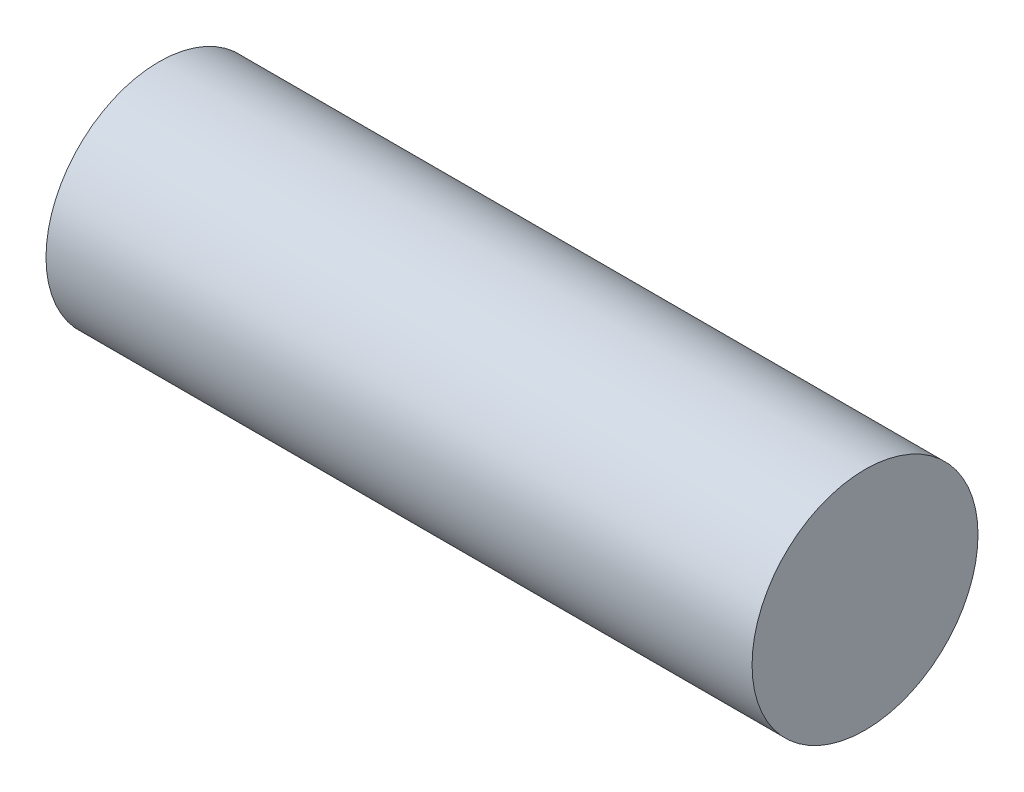
ISO-10303-21;
HEADER;
FILE_DESCRIPTION(('STEP AP214'),'2;1');
FILE_NAME('part.step','',(''),(''),'','','');
FILE_SCHEMA(('AUTOMOTIVE_DESIGN { 1 0 10303 214 1 1 1 1 }'));
ENDSEC;
DATA;
#1=APPLICATION_CONTEXT('core data for automotive mechanical design processes');
#2=APPLICATION_PROTOCOL_DEFINITION('international standard','automotive_design',2000,#1);
#3=PRODUCT_CONTEXT('',#1,'mechanical');
#4=PRODUCT('Part','Part','',(#3));
#5=PRODUCT_RELATED_PRODUCT_CATEGORY('part','',(#4));
#6=PRODUCT_DEFINITION_FORMATION('','',#4);
#7=PRODUCT_DEFINITION_CONTEXT('part definition',#1,'design');
#8=PRODUCT_DEFINITION('design','',#6,#7);
#9=PRODUCT_DEFINITION_SHAPE('','',#8);
#10=(LENGTH_UNIT() NAMED_UNIT(*) SI_UNIT(.MILLI.,.METRE.));
#11=(NAMED_UNIT(*) PLANE_ANGLE_UNIT() SI_UNIT($,.RADIAN.));
#12=(NAMED_UNIT(*) SI_UNIT($,.STERADIAN.) SOLID_ANGLE_UNIT());
#13=UNCERTAINTY_MEASURE_WITH_UNIT(LENGTH_MEASURE(1.E-05),#10,'distance_accuracy_value','');
#14=(GEOMETRIC_REPRESENTATION_CONTEXT(3) GLOBAL_UNCERTAINTY_ASSIGNED_CONTEXT((#13)) GLOBAL_UNIT_ASSIGNED_CONTEXT((#10,
#11,#12)) REPRESENTATION_CONTEXT('',''));
#15=CARTESIAN_POINT('',(0.,0.,0.));
#16=DIRECTION('',(0.,0.,1.));
#17=DIRECTION('',(1.,0.,0.));
#18=AXIS2_PLACEMENT_3D('',#15,#16,#17);
#19=CARTESIAN_POINT('',(25.,0.,0.));
#20=DIRECTION('',(-1.,0.,0.));
#21=DIRECTION('',(0.,0.,-1.));
#22=AXIS2_PLACEMENT_3D('',#19,#20,#21);
#23=CYLINDRICAL_SURFACE('',#22,4.);
#24=CARTESIAN_POINT('',(25.,0.,0.));
#25=DIRECTION('',(-1.,0.,0.));
#26=DIRECTION('',(0.,0.,1.));
#27=AXIS2_PLACEMENT_3D('',#24,#25,#26);
#28=CIRCLE('',#27,4.);
#29=CARTESIAN_POINT('',(25.,0.,4.));
#30=VERTEX_POINT('',#29);
#31=EDGE_CURVE('E10',#30,#30,#28,.T.);
#32=ORIENTED_EDGE('',*,*,#31,.T.);
#33=EDGE_LOOP('',(#32));
#34=FACE_BOUND('',#33,.T.);
#35=CARTESIAN_POINT('',(0.,0.,0.));
#36=DIRECTION('',(-1.,0.,0.));
#37=DIRECTION('',(0.,0.,1.));
#38=AXIS2_PLACEMENT_3D('',#35,#36,#37);
#39=CIRCLE('',#38,4.);
#40=CARTESIAN_POINT('',(0.,0.,4.));
#41=VERTEX_POINT('',#40);
#42=EDGE_CURVE('E38',#41,#41,#39,.T.);
#43=ORIENTED_EDGE('',*,*,#42,.F.);
#44=EDGE_LOOP('',(#43));
#45=FACE_BOUND('',#44,.T.);
#46=ADVANCED_FACE('F35',(#34,#45),#23,.T.);
#47=CARTESIAN_POINT('',(25.,0.,0.));
#48=DIRECTION('',(1.,0.,0.));
#49=DIRECTION('',(0.,0.,1.));
#50=AXIS2_PLACEMENT_3D('',#47,#48,#49);
#51=PLANE('',#50);
#52=ORIENTED_EDGE('',*,*,#31,.F.);
#53=EDGE_LOOP('',(#52));
#54=FACE_BOUND('',#53,.T.);
#55=ADVANCED_FACE('F50',(#54),#51,.T.);
#56=CARTESIAN_POINT('',(0.,0.,0.));
#57=DIRECTION('',(1.,0.,0.));
#58=DIRECTION('',(0.,0.,1.));
#59=AXIS2_PLACEMENT_3D('',#56,#57,#58);
#60=PLANE('',#59);
#61=ORIENTED_EDGE('',*,*,#42,.T.);
#62=EDGE_LOOP('',(#61));
#63=FACE_BOUND('',#62,.T.);
#64=ADVANCED_FACE('F47',(#63),#60,.F.);
#65=CLOSED_SHELL('',(#46,#55,#64));
#66=MANIFOLD_SOLID_BREP('B2',#65);
#67=ADVANCED_BREP_SHAPE_REPRESENTATION('',(#18,#66),#14);
#68=SHAPE_DEFINITION_REPRESENTATION(#9,#67);
ENDSEC;
END-ISO-10303-21;
